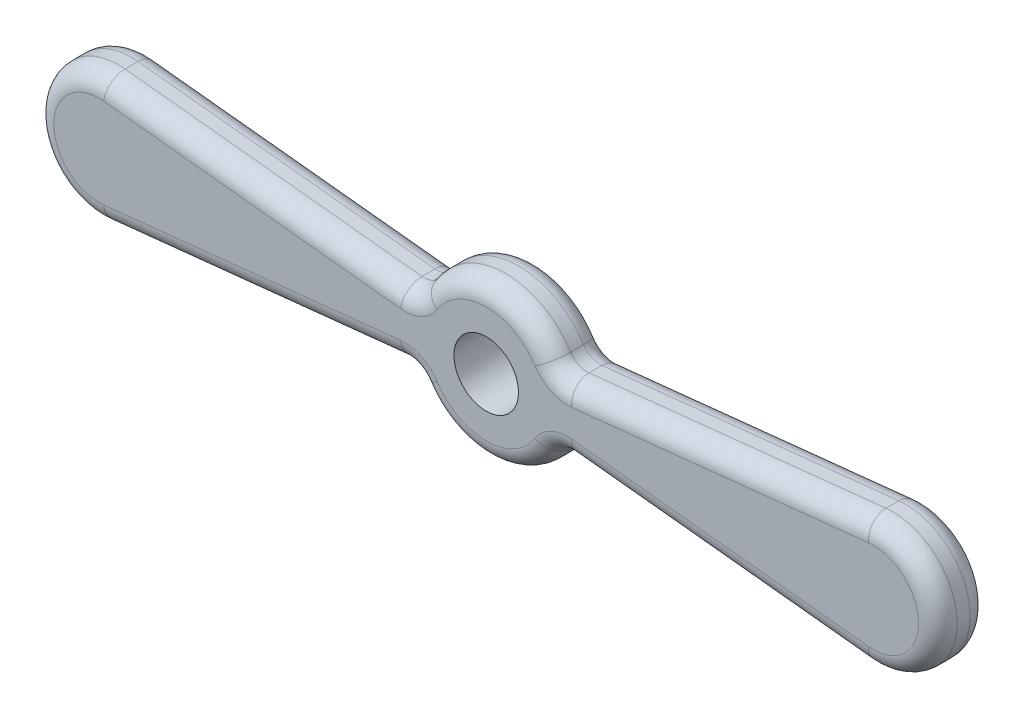
ISO-10303-21;
HEADER;
FILE_DESCRIPTION(('STEP AP214'),'2;1');
FILE_NAME('part.step','',(''),(''),'','','');
FILE_SCHEMA(('AUTOMOTIVE_DESIGN { 1 0 10303 214 1 1 1 1 }'));
ENDSEC;
DATA;
#1=APPLICATION_CONTEXT('core data for automotive mechanical design processes');
#2=APPLICATION_PROTOCOL_DEFINITION('international standard','automotive_design',2000,#1);
#3=PRODUCT_CONTEXT('',#1,'mechanical');
#4=PRODUCT('Part','Part','',(#3));
#5=PRODUCT_RELATED_PRODUCT_CATEGORY('part','',(#4));
#6=PRODUCT_DEFINITION_FORMATION('','',#4);
#7=PRODUCT_DEFINITION_CONTEXT('part definition',#1,'design');
#8=PRODUCT_DEFINITION('design','',#6,#7);
#9=PRODUCT_DEFINITION_SHAPE('','',#8);
#10=(LENGTH_UNIT() NAMED_UNIT(*) SI_UNIT(.MILLI.,.METRE.));
#11=(NAMED_UNIT(*) PLANE_ANGLE_UNIT() SI_UNIT($,.RADIAN.));
#12=(NAMED_UNIT(*) SI_UNIT($,.STERADIAN.) SOLID_ANGLE_UNIT());
#13=UNCERTAINTY_MEASURE_WITH_UNIT(LENGTH_MEASURE(1.E-05),#10,'distance_accuracy_value','');
#14=(GEOMETRIC_REPRESENTATION_CONTEXT(3) GLOBAL_UNCERTAINTY_ASSIGNED_CONTEXT((#13)) GLOBAL_UNIT_ASSIGNED_CONTEXT((#10,
#11,#12)) REPRESENTATION_CONTEXT('',''));
#15=CARTESIAN_POINT('',(0.,0.,0.));
#16=DIRECTION('',(0.,0.,1.));
#17=DIRECTION('',(1.,0.,0.));
#18=AXIS2_PLACEMENT_3D('',#15,#16,#17);
#19=CARTESIAN_POINT('',(60.,0.,8.));
#20=DIRECTION('',(0.,0.,1.));
#21=DIRECTION('',(1.,0.,0.));
#22=AXIS2_PLACEMENT_3D('',#19,#20,#21);
#23=PLANE('',#22);
#24=CARTESIAN_POINT('',(12.6296055117587,-8.09277854740601,8.));
#25=DIRECTION('',(0.,0.,1.));
#26=DIRECTION('',(1.,0.,0.));
#27=AXIS2_PLACEMENT_3D('',#24,#25,#26);
#28=CIRCLE('',#27,6.);
#29=CARTESIAN_POINT('',(7.57776330705521,-4.85566712844361,8.));
#30=VERTEX_POINT('',#29);
#31=CARTESIAN_POINT('',(13.2567762913646,-2.12564717519637,8.));
#32=VERTEX_POINT('',#31);
#33=EDGE_CURVE('E241',#30,#32,#28,.F.);
#34=ORIENTED_EDGE('',*,*,#33,.T.);
#35=DIRECTION('',(0.994521895368274,-0.104528463267647,0.));
#36=VECTOR('',#35,1.);
#37=CARTESIAN_POINT('',(59.2683007571265,-6.96165326757792,8.));
#38=LINE('',#37,#36);
#39=CARTESIAN_POINT('',(59.2683007571265,-6.96165326757792,8.));
#40=VERTEX_POINT('',#39);
#41=EDGE_CURVE('E249',#32,#40,#38,.T.);
#42=ORIENTED_EDGE('',*,*,#41,.T.);
#43=CARTESIAN_POINT('',(60.,0.,8.));
#44=DIRECTION('',(0.,0.,1.));
#45=DIRECTION('',(1.,0.,0.));
#46=AXIS2_PLACEMENT_3D('',#43,#44,#45);
#47=CIRCLE('',#46,7.);
#48=CARTESIAN_POINT('',(59.2683007571265,6.96165326757791,8.));
#49=VERTEX_POINT('',#48);
#50=EDGE_CURVE('E247',#40,#49,#47,.T.);
#51=ORIENTED_EDGE('',*,*,#50,.T.);
#52=DIRECTION('',(-0.994521895368274,-0.104528463267647,0.));
#53=VECTOR('',#52,1.);
#54=CARTESIAN_POINT('',(13.2567762913645,2.12564717519637,8.));
#55=LINE('',#54,#53);
#56=CARTESIAN_POINT('',(13.2567762913646,2.12564717519637,8.));
#57=VERTEX_POINT('',#56);
#58=EDGE_CURVE('E245',#49,#57,#55,.T.);
#59=ORIENTED_EDGE('',*,*,#58,.T.);
#60=CARTESIAN_POINT('',(12.6296055117587,8.09277854740601,8.));
#61=DIRECTION('',(0.,0.,1.));
#62=DIRECTION('',(1.,0.,0.));
#63=AXIS2_PLACEMENT_3D('',#60,#61,#62);
#64=CIRCLE('',#63,6.);
#65=CARTESIAN_POINT('',(7.57776330705521,4.85566712844361,8.));
#66=VERTEX_POINT('',#65);
#67=EDGE_CURVE('E243',#57,#66,#64,.F.);
#68=ORIENTED_EDGE('',*,*,#67,.T.);
#69=CARTESIAN_POINT('',(0.,0.,8.));
#70=DIRECTION('',(0.,0.,1.));
#71=DIRECTION('',(1.,0.,0.));
#72=AXIS2_PLACEMENT_3D('',#69,#70,#71);
#73=CIRCLE('',#72,9.);
#74=CARTESIAN_POINT('',(-7.57776330705521,4.85566712844361,8.));
#75=VERTEX_POINT('',#74);
#76=EDGE_CURVE('E230',#66,#75,#73,.T.);
#77=ORIENTED_EDGE('',*,*,#76,.T.);
#78=CARTESIAN_POINT('',(-12.6296055117587,8.09277854740601,8.));
#79=DIRECTION('',(0.,0.,1.));
#80=DIRECTION('',(1.,0.,0.));
#81=AXIS2_PLACEMENT_3D('',#78,#79,#80);
#82=CIRCLE('',#81,6.);
#83=CARTESIAN_POINT('',(-13.2567762913646,2.12564717519637,8.));
#84=VERTEX_POINT('',#83);
#85=EDGE_CURVE('E211',#75,#84,#82,.F.);
#86=ORIENTED_EDGE('',*,*,#85,.T.);
#87=DIRECTION('',(-0.994521895368274,0.104528463267647,0.));
#88=VECTOR('',#87,1.);
#89=CARTESIAN_POINT('',(-59.2683007571265,6.96165326757791,8.));
#90=LINE('',#89,#88);
#91=CARTESIAN_POINT('',(-59.2683007571265,6.96165326757791,8.));
#92=VERTEX_POINT('',#91);
#93=EDGE_CURVE('E219',#84,#92,#90,.T.);
#94=ORIENTED_EDGE('',*,*,#93,.T.);
#95=CARTESIAN_POINT('',(-60.,0.,8.));
#96=DIRECTION('',(0.,0.,1.));
#97=DIRECTION('',(1.,0.,0.));
#98=AXIS2_PLACEMENT_3D('',#95,#96,#97);
#99=CIRCLE('',#98,7.);
#100=CARTESIAN_POINT('',(-59.2683007571265,-6.96165326757791,8.));
#101=VERTEX_POINT('',#100);
#102=EDGE_CURVE('E225',#92,#101,#99,.T.);
#103=ORIENTED_EDGE('',*,*,#102,.T.);
#104=DIRECTION('',(0.994521895368274,0.104528463267647,0.));
#105=VECTOR('',#104,1.);
#106=CARTESIAN_POINT('',(-13.2567762913645,-2.12564717519636,8.));
#107=LINE('',#106,#105);
#108=CARTESIAN_POINT('',(-13.2567762913646,-2.12564717519637,8.));
#109=VERTEX_POINT('',#108);
#110=EDGE_CURVE('E236',#101,#109,#107,.T.);
#111=ORIENTED_EDGE('',*,*,#110,.T.);
#112=CARTESIAN_POINT('',(-12.6296055117587,-8.09277854740601,8.));
#113=DIRECTION('',(0.,0.,1.));
#114=DIRECTION('',(1.,0.,0.));
#115=AXIS2_PLACEMENT_3D('',#112,#113,#114);
#116=CIRCLE('',#115,6.);
#117=CARTESIAN_POINT('',(-7.57776330705521,-4.85566712844361,8.));
#118=VERTEX_POINT('',#117);
#119=EDGE_CURVE('E233',#109,#118,#116,.F.);
#120=ORIENTED_EDGE('',*,*,#119,.T.);
#121=CARTESIAN_POINT('',(0.,0.,8.));
#122=DIRECTION('',(0.,0.,1.));
#123=DIRECTION('',(1.,0.,0.));
#124=AXIS2_PLACEMENT_3D('',#121,#122,#123);
#125=CIRCLE('',#124,9.);
#126=EDGE_CURVE('E232',#118,#30,#125,.T.);
#127=ORIENTED_EDGE('',*,*,#126,.T.);
#128=EDGE_LOOP('',(#34,#42,#51,#59,#68,#77,#86,#94,#103,#111,#120,#127));
#129=FACE_BOUND('',#128,.T.);
#130=CARTESIAN_POINT('',(0.,0.,8.));
#131=DIRECTION('',(0.,0.,1.));
#132=DIRECTION('',(1.,0.,0.));
#133=AXIS2_PLACEMENT_3D('',#130,#131,#132);
#134=CIRCLE('',#133,5.);
#135=CARTESIAN_POINT('',(5.,0.,8.));
#136=VERTEX_POINT('',#135);
#137=EDGE_CURVE('E441',#136,#136,#134,.T.);
#138=ORIENTED_EDGE('',*,*,#137,.F.);
#139=EDGE_LOOP('',(#138));
#140=FACE_BOUND('',#139,.T.);
#141=ADVANCED_FACE('F42',(#129,#140),#23,.T.);
#142=CARTESIAN_POINT('',(60.,0.,0.));
#143=DIRECTION('',(0.,0.,1.));
#144=DIRECTION('',(1.,0.,0.));
#145=AXIS2_PLACEMENT_3D('',#142,#143,#144);
#146=PLANE('',#145);
#147=DIRECTION('',(-0.994521895368274,0.104528463267647,0.));
#148=VECTOR('',#147,1.);
#149=CARTESIAN_POINT('',(59.420555286902,-5.51304818148684,0.));
#150=LINE('',#149,#148);
#151=CARTESIAN_POINT('',(-59.2683007571265,6.96165326757791,0.));
#152=VERTEX_POINT('',#151);
#153=CARTESIAN_POINT('',(-13.2567762913646,2.12564717519637,0.));
#154=VERTEX_POINT('',#153);
#155=EDGE_CURVE('E276',#152,#154,#150,.F.);
#156=ORIENTED_EDGE('',*,*,#155,.T.);
#157=CARTESIAN_POINT('',(-12.6296055117587,8.09277854740601,0.));
#158=DIRECTION('',(0.,0.,1.));
#159=DIRECTION('',(1.,0.,0.));
#160=AXIS2_PLACEMENT_3D('',#157,#158,#159);
#161=CIRCLE('',#160,6.);
#162=CARTESIAN_POINT('',(-7.57776330705521,4.85566712844361,0.));
#163=VERTEX_POINT('',#162);
#164=EDGE_CURVE('E329',#154,#163,#161,.T.);
#165=ORIENTED_EDGE('',*,*,#164,.T.);
#166=CARTESIAN_POINT('',(0.,0.,0.));
#167=DIRECTION('',(0.,0.,1.));
#168=DIRECTION('',(1.,0.,0.));
#169=AXIS2_PLACEMENT_3D('',#166,#167,#168);
#170=CIRCLE('',#169,9.);
#171=CARTESIAN_POINT('',(7.57776330705521,4.85566712844361,0.));
#172=VERTEX_POINT('',#171);
#173=EDGE_CURVE('E327',#163,#172,#170,.F.);
#174=ORIENTED_EDGE('',*,*,#173,.T.);
#175=CARTESIAN_POINT('',(12.6296055117587,8.09277854740601,0.));
#176=DIRECTION('',(0.,0.,1.));
#177=DIRECTION('',(1.,0.,0.));
#178=AXIS2_PLACEMENT_3D('',#175,#176,#177);
#179=CIRCLE('',#178,6.);
#180=CARTESIAN_POINT('',(13.2567762913646,2.12564717519637,0.));
#181=VERTEX_POINT('',#180);
#182=EDGE_CURVE('E325',#172,#181,#179,.T.);
#183=ORIENTED_EDGE('',*,*,#182,.T.);
#184=DIRECTION('',(-0.994521895368274,-0.104528463267647,0.));
#185=VECTOR('',#184,1.);
#186=CARTESIAN_POINT('',(59.2683007571265,6.96165326757792,0.));
#187=LINE('',#186,#185);
#188=CARTESIAN_POINT('',(59.2683007571265,6.96165326757791,0.));
#189=VERTEX_POINT('',#188);
#190=EDGE_CURVE('E323',#181,#189,#187,.F.);
#191=ORIENTED_EDGE('',*,*,#190,.T.);
#192=CARTESIAN_POINT('',(60.,0.,0.));
#193=DIRECTION('',(0.,0.,1.));
#194=DIRECTION('',(1.,0.,0.));
#195=AXIS2_PLACEMENT_3D('',#192,#193,#194);
#196=CIRCLE('',#195,7.);
#197=CARTESIAN_POINT('',(59.2683007571265,-6.96165326757791,0.));
#198=VERTEX_POINT('',#197);
#199=EDGE_CURVE('E321',#189,#198,#196,.F.);
#200=ORIENTED_EDGE('',*,*,#199,.T.);
#201=DIRECTION('',(0.994521895368274,-0.104528463267647,0.));
#202=VECTOR('',#201,1.);
#203=CARTESIAN_POINT('',(59.2683007571265,-6.96165326757791,0.));
#204=LINE('',#203,#202);
#205=CARTESIAN_POINT('',(13.2567762913646,-2.12564717519637,0.));
#206=VERTEX_POINT('',#205);
#207=EDGE_CURVE('E319',#198,#206,#204,.F.);
#208=ORIENTED_EDGE('',*,*,#207,.T.);
#209=CARTESIAN_POINT('',(12.6296055117587,-8.09277854740601,0.));
#210=DIRECTION('',(0.,0.,1.));
#211=DIRECTION('',(1.,0.,0.));
#212=AXIS2_PLACEMENT_3D('',#209,#210,#211);
#213=CIRCLE('',#212,6.);
#214=CARTESIAN_POINT('',(7.57776330705521,-4.85566712844361,0.));
#215=VERTEX_POINT('',#214);
#216=EDGE_CURVE('E317',#206,#215,#213,.T.);
#217=ORIENTED_EDGE('',*,*,#216,.T.);
#218=CARTESIAN_POINT('',(0.,0.,0.));
#219=DIRECTION('',(0.,0.,1.));
#220=DIRECTION('',(1.,0.,0.));
#221=AXIS2_PLACEMENT_3D('',#218,#219,#220);
#222=CIRCLE('',#221,9.);
#223=CARTESIAN_POINT('',(-7.57776330705521,-4.85566712844361,0.));
#224=VERTEX_POINT('',#223);
#225=EDGE_CURVE('E315',#215,#224,#222,.F.);
#226=ORIENTED_EDGE('',*,*,#225,.T.);
#227=CARTESIAN_POINT('',(-12.6296055117587,-8.09277854740601,0.));
#228=DIRECTION('',(0.,0.,1.));
#229=DIRECTION('',(1.,0.,0.));
#230=AXIS2_PLACEMENT_3D('',#227,#228,#229);
#231=CIRCLE('',#230,6.);
#232=CARTESIAN_POINT('',(-13.2567762913646,-2.12564717519637,0.));
#233=VERTEX_POINT('',#232);
#234=EDGE_CURVE('E313',#224,#233,#231,.T.);
#235=ORIENTED_EDGE('',*,*,#234,.T.);
#236=DIRECTION('',(0.994521895368274,0.104528463267647,0.));
#237=VECTOR('',#236,1.);
#238=CARTESIAN_POINT('',(59.420555286902,5.51304818148684,0.));
#239=LINE('',#238,#237);
#240=CARTESIAN_POINT('',(-59.2683007571265,-6.96165326757791,0.));
#241=VERTEX_POINT('',#240);
#242=EDGE_CURVE('E311',#233,#241,#239,.F.);
#243=ORIENTED_EDGE('',*,*,#242,.T.);
#244=CARTESIAN_POINT('',(-60.,0.,0.));
#245=DIRECTION('',(0.,0.,1.));
#246=DIRECTION('',(1.,0.,0.));
#247=AXIS2_PLACEMENT_3D('',#244,#245,#246);
#248=CIRCLE('',#247,7.);
#249=EDGE_CURVE('E309',#241,#152,#248,.F.);
#250=ORIENTED_EDGE('',*,*,#249,.T.);
#251=EDGE_LOOP('',(#156,#165,#174,#183,#191,#200,#208,#217,#226,#235,#243,#250));
#252=FACE_BOUND('',#251,.T.);
#253=CARTESIAN_POINT('',(0.,0.,0.));
#254=DIRECTION('',(0.,0.,1.));
#255=DIRECTION('',(1.,0.,0.));
#256=AXIS2_PLACEMENT_3D('',#253,#254,#255);
#257=CIRCLE('',#256,5.);
#258=CARTESIAN_POINT('',(5.,0.,0.));
#259=VERTEX_POINT('',#258);
#260=EDGE_CURVE('E307',#259,#259,#257,.T.);
#261=ORIENTED_EDGE('',*,*,#260,.T.);
#262=EDGE_LOOP('',(#261));
#263=FACE_BOUND('',#262,.T.);
#264=ADVANCED_FACE('F510',(#252,#263),#146,.F.);
#265=CARTESIAN_POINT('',(60.,0.,8.));
#266=DIRECTION('',(0.,0.,-1.));
#267=DIRECTION('',(-1.,0.,0.));
#268=AXIS2_PLACEMENT_3D('',#265,#266,#267);
#269=CYLINDRICAL_SURFACE('',#268,10.);
#270=DIRECTION('',(0.,0.,-1.));
#271=VECTOR('',#270,1.);
#272=CARTESIAN_POINT('',(58.9547153673235,-9.94521895368274,8.));
#273=LINE('',#272,#271);
#274=CARTESIAN_POINT('',(58.9547153673235,-9.94521895368274,5.));
#275=VERTEX_POINT('',#274);
#276=CARTESIAN_POINT('',(58.9547153673235,-9.94521895368274,3.));
#277=VERTEX_POINT('',#276);
#278=EDGE_CURVE('E437',#275,#277,#273,.T.);
#279=ORIENTED_EDGE('',*,*,#278,.T.);
#280=CARTESIAN_POINT('',(60.,0.,3.));
#281=DIRECTION('',(0.,0.,1.));
#282=DIRECTION('',(1.,0.,0.));
#283=AXIS2_PLACEMENT_3D('',#280,#281,#282);
#284=CIRCLE('',#283,10.);
#285=CARTESIAN_POINT('',(58.9547153673235,9.94521895368274,3.));
#286=VERTEX_POINT('',#285);
#287=EDGE_CURVE('E341',#277,#286,#284,.T.);
#288=ORIENTED_EDGE('',*,*,#287,.T.);
#289=DIRECTION('',(0.,0.,-1.));
#290=VECTOR('',#289,1.);
#291=CARTESIAN_POINT('',(58.9547153673235,9.94521895368274,8.));
#292=LINE('',#291,#290);
#293=CARTESIAN_POINT('',(58.9547153673235,9.94521895368274,5.));
#294=VERTEX_POINT('',#293);
#295=EDGE_CURVE('E439',#294,#286,#292,.T.);
#296=ORIENTED_EDGE('',*,*,#295,.F.);
#297=CARTESIAN_POINT('',(60.,0.,5.));
#298=DIRECTION('',(0.,0.,1.));
#299=DIRECTION('',(1.,0.,0.));
#300=AXIS2_PLACEMENT_3D('',#297,#298,#299);
#301=CIRCLE('',#300,10.);
#302=EDGE_CURVE('E260',#294,#275,#301,.F.);
#303=ORIENTED_EDGE('',*,*,#302,.T.);
#304=EDGE_LOOP('',(#279,#288,#296,#303));
#305=FACE_BOUND('',#304,.T.);
#306=ADVANCED_FACE('F515',(#305),#269,.T.);
#307=CARTESIAN_POINT('',(58.9547153673235,9.94521895368274,8.));
#308=DIRECTION('',(0.104528463267647,-0.994521895368274,0.));
#309=DIRECTION('',(0.994521895368274,0.104528463267647,0.));
#310=AXIS2_PLACEMENT_3D('',#307,#308,#309);
#311=PLANE('',#310);
#312=ORIENTED_EDGE('',*,*,#295,.T.);
#313=DIRECTION('',(-0.994521895368274,-0.104528463267647,0.));
#314=VECTOR('',#313,1.);
#315=CARTESIAN_POINT('',(58.9547153673235,9.94521895368274,3.));
#316=LINE('',#315,#314);
#317=CARTESIAN_POINT('',(12.9431909015616,5.10921286130119,3.));
#318=VERTEX_POINT('',#317);
#319=EDGE_CURVE('E339',#286,#318,#316,.T.);
#320=ORIENTED_EDGE('',*,*,#319,.T.);
#321=DIRECTION('',(0.,0.,1.));
#322=VECTOR('',#321,1.);
#323=CARTESIAN_POINT('',(12.9431909015616,5.10921286130119,8.));
#324=LINE('',#323,#322);
#325=CARTESIAN_POINT('',(12.9431909015616,5.10921286130119,5.));
#326=VERTEX_POINT('',#325);
#327=EDGE_CURVE('E226',#318,#326,#324,.T.);
#328=ORIENTED_EDGE('',*,*,#327,.T.);
#329=DIRECTION('',(-0.994521895368274,-0.104528463267647,0.));
#330=VECTOR('',#329,1.);
#331=CARTESIAN_POINT('',(58.9547153673235,9.94521895368274,5.));
#332=LINE('',#331,#330);
#333=EDGE_CURVE('E262',#326,#294,#332,.F.);
#334=ORIENTED_EDGE('',*,*,#333,.T.);
#335=EDGE_LOOP('',(#312,#320,#328,#334));
#336=FACE_BOUND('',#335,.T.);
#337=ADVANCED_FACE('F534',(#336),#311,.F.);
#338=CARTESIAN_POINT('',(0.,0.,8.));
#339=DIRECTION('',(0.,0.,-1.));
#340=DIRECTION('',(-1.,0.,0.));
#341=AXIS2_PLACEMENT_3D('',#338,#339,#340);
#342=CYLINDRICAL_SURFACE('',#341,12.);
#343=DIRECTION('',(0.,0.,-1.));
#344=VECTOR('',#343,1.);
#345=CARTESIAN_POINT('',(10.1036844094069,6.47422283792481,8.));
#346=LINE('',#345,#344);
#347=CARTESIAN_POINT('',(10.1036844094069,6.47422283792481,5.));
#348=VERTEX_POINT('',#347);
#349=CARTESIAN_POINT('',(10.1036844094069,6.47422283792481,3.));
#350=VERTEX_POINT('',#349);
#351=EDGE_CURVE('E449',#348,#350,#346,.T.);
#352=ORIENTED_EDGE('',*,*,#351,.T.);
#353=CARTESIAN_POINT('',(0.,0.,3.));
#354=DIRECTION('',(0.,0.,1.));
#355=DIRECTION('',(1.,0.,0.));
#356=AXIS2_PLACEMENT_3D('',#353,#354,#355);
#357=CIRCLE('',#356,12.);
#358=CARTESIAN_POINT('',(-10.1036844094069,6.47422283792481,3.));
#359=VERTEX_POINT('',#358);
#360=EDGE_CURVE('E335',#350,#359,#357,.T.);
#361=ORIENTED_EDGE('',*,*,#360,.T.);
#362=DIRECTION('',(0.,0.,-1.));
#363=VECTOR('',#362,1.);
#364=CARTESIAN_POINT('',(-10.1036844094069,6.47422283792481,8.));
#365=LINE('',#364,#363);
#366=CARTESIAN_POINT('',(-10.1036844094069,6.47422283792481,5.));
#367=VERTEX_POINT('',#366);
#368=EDGE_CURVE('E452',#359,#367,#365,.F.);
#369=ORIENTED_EDGE('',*,*,#368,.T.);
#370=CARTESIAN_POINT('',(0.,0.,5.));
#371=DIRECTION('',(0.,0.,1.));
#372=DIRECTION('',(1.,0.,0.));
#373=AXIS2_PLACEMENT_3D('',#370,#371,#372);
#374=CIRCLE('',#373,12.);
#375=EDGE_CURVE('E264',#367,#348,#374,.F.);
#376=ORIENTED_EDGE('',*,*,#375,.T.);
#377=EDGE_LOOP('',(#352,#361,#369,#376));
#378=FACE_BOUND('',#377,.T.);
#379=ADVANCED_FACE('F531',(#378),#342,.T.);
#380=CARTESIAN_POINT('',(-58.9547153673235,9.94521895368274,8.));
#381=DIRECTION('',(-0.104528463267647,-0.994521895368274,0.));
#382=DIRECTION('',(0.994521895368274,-0.104528463267647,0.));
#383=AXIS2_PLACEMENT_3D('',#380,#381,#382);
#384=PLANE('',#383);
#385=DIRECTION('',(0.,0.,1.));
#386=VECTOR('',#385,1.);
#387=CARTESIAN_POINT('',(-12.9431909015616,5.10921286130119,0.));
#388=LINE('',#387,#386);
#389=CARTESIAN_POINT('',(-12.9431909015616,5.10921286130119,5.));
#390=VERTEX_POINT('',#389);
#391=CARTESIAN_POINT('',(-12.9431909015616,5.10921286130119,3.));
#392=VERTEX_POINT('',#391);
#393=EDGE_CURVE('E447',#390,#392,#388,.F.);
#394=ORIENTED_EDGE('',*,*,#393,.T.);
#395=DIRECTION('',(-0.994521895368274,0.104528463267647,0.));
#396=VECTOR('',#395,1.);
#397=CARTESIAN_POINT('',(-58.9547153673235,9.94521895368274,3.));
#398=LINE('',#397,#396);
#399=CARTESIAN_POINT('',(-58.9547153673235,9.94521895368274,3.));
#400=VERTEX_POINT('',#399);
#401=EDGE_CURVE('E11',#392,#400,#398,.T.);
#402=ORIENTED_EDGE('',*,*,#401,.T.);
#403=DIRECTION('',(0.,0.,-1.));
#404=VECTOR('',#403,1.);
#405=CARTESIAN_POINT('',(-58.9547153673235,9.94521895368274,8.));
#406=LINE('',#405,#404);
#407=CARTESIAN_POINT('',(-58.9547153673235,9.94521895368274,5.));
#408=VERTEX_POINT('',#407);
#409=EDGE_CURVE('E436',#408,#400,#406,.T.);
#410=ORIENTED_EDGE('',*,*,#409,.F.);
#411=DIRECTION('',(-0.994521895368274,0.104528463267647,0.));
#412=VECTOR('',#411,1.);
#413=CARTESIAN_POINT('',(-12.9431909015616,5.10921286130119,5.));
#414=LINE('',#413,#412);
#415=EDGE_CURVE('E275',#408,#390,#414,.F.);
#416=ORIENTED_EDGE('',*,*,#415,.T.);
#417=EDGE_LOOP('',(#394,#402,#410,#416));
#418=FACE_BOUND('',#417,.T.);
#419=ADVANCED_FACE('F498',(#418),#384,.F.);
#420=CARTESIAN_POINT('',(-60.,0.,8.));
#421=DIRECTION('',(0.,0.,-1.));
#422=DIRECTION('',(-1.,0.,0.));
#423=AXIS2_PLACEMENT_3D('',#420,#421,#422);
#424=CYLINDRICAL_SURFACE('',#423,10.);
#425=ORIENTED_EDGE('',*,*,#409,.T.);
#426=CARTESIAN_POINT('',(-60.,0.,3.));
#427=DIRECTION('',(0.,0.,1.));
#428=DIRECTION('',(1.,0.,0.));
#429=AXIS2_PLACEMENT_3D('',#426,#427,#428);
#430=CIRCLE('',#429,10.);
#431=CARTESIAN_POINT('',(-58.9547153673235,-9.94521895368274,3.));
#432=VERTEX_POINT('',#431);
#433=EDGE_CURVE('E51',#400,#432,#430,.T.);
#434=ORIENTED_EDGE('',*,*,#433,.T.);
#435=DIRECTION('',(0.,0.,-1.));
#436=VECTOR('',#435,1.);
#437=CARTESIAN_POINT('',(-58.9547153673235,-9.94521895368274,8.));
#438=LINE('',#437,#436);
#439=CARTESIAN_POINT('',(-58.9547153673235,-9.94521895368274,5.));
#440=VERTEX_POINT('',#439);
#441=EDGE_CURVE('E432',#440,#432,#438,.T.);
#442=ORIENTED_EDGE('',*,*,#441,.F.);
#443=CARTESIAN_POINT('',(-60.,0.,5.));
#444=DIRECTION('',(0.,0.,1.));
#445=DIRECTION('',(1.,0.,0.));
#446=AXIS2_PLACEMENT_3D('',#443,#444,#445);
#447=CIRCLE('',#446,10.);
#448=EDGE_CURVE('E273',#440,#408,#447,.F.);
#449=ORIENTED_EDGE('',*,*,#448,.T.);
#450=EDGE_LOOP('',(#425,#434,#442,#449));
#451=FACE_BOUND('',#450,.T.);
#452=ADVANCED_FACE('F435',(#451),#424,.T.);
#453=CARTESIAN_POINT('',(-58.9547153673235,-9.94521895368274,8.));
#454=DIRECTION('',(-0.104528463267647,0.994521895368274,0.));
#455=DIRECTION('',(-0.994521895368274,-0.104528463267647,0.));
#456=AXIS2_PLACEMENT_3D('',#453,#454,#455);
#457=PLANE('',#456);
#458=ORIENTED_EDGE('',*,*,#441,.T.);
#459=DIRECTION('',(0.994521895368274,0.104528463267647,0.));
#460=VECTOR('',#459,1.);
#461=CARTESIAN_POINT('',(-58.9547153673235,-9.94521895368274,3.));
#462=LINE('',#461,#460);
#463=CARTESIAN_POINT('',(-12.9431909015616,-5.10921286130119,3.));
#464=VERTEX_POINT('',#463);
#465=EDGE_CURVE('E351',#432,#464,#462,.T.);
#466=ORIENTED_EDGE('',*,*,#465,.T.);
#467=DIRECTION('',(0.,0.,1.));
#468=VECTOR('',#467,1.);
#469=CARTESIAN_POINT('',(-12.9431909015616,-5.10921286130119,8.));
#470=LINE('',#469,#468);
#471=CARTESIAN_POINT('',(-12.9431909015616,-5.10921286130119,5.));
#472=VERTEX_POINT('',#471);
#473=EDGE_CURVE('E410',#464,#472,#470,.T.);
#474=ORIENTED_EDGE('',*,*,#473,.T.);
#475=DIRECTION('',(0.994521895368274,0.104528463267647,0.));
#476=VECTOR('',#475,1.);
#477=CARTESIAN_POINT('',(-58.9547153673235,-9.94521895368274,5.));
#478=LINE('',#477,#476);
#479=EDGE_CURVE('E271',#472,#440,#478,.F.);
#480=ORIENTED_EDGE('',*,*,#479,.T.);
#481=EDGE_LOOP('',(#458,#466,#474,#480));
#482=FACE_BOUND('',#481,.T.);
#483=ADVANCED_FACE('F431',(#482),#457,.F.);
#484=CARTESIAN_POINT('',(0.,0.,8.));
#485=DIRECTION('',(0.,0.,-1.));
#486=DIRECTION('',(-1.,0.,0.));
#487=AXIS2_PLACEMENT_3D('',#484,#485,#486);
#488=CYLINDRICAL_SURFACE('',#487,12.);
#489=DIRECTION('',(0.,0.,-1.));
#490=VECTOR('',#489,1.);
#491=CARTESIAN_POINT('',(-10.1036844094069,-6.47422283792481,8.));
#492=LINE('',#491,#490);
#493=CARTESIAN_POINT('',(-10.1036844094069,-6.47422283792481,5.));
#494=VERTEX_POINT('',#493);
#495=CARTESIAN_POINT('',(-10.1036844094069,-6.47422283792481,3.));
#496=VERTEX_POINT('',#495);
#497=EDGE_CURVE('E413',#494,#496,#492,.T.);
#498=ORIENTED_EDGE('',*,*,#497,.T.);
#499=CARTESIAN_POINT('',(0.,0.,3.));
#500=DIRECTION('',(0.,0.,1.));
#501=DIRECTION('',(1.,0.,0.));
#502=AXIS2_PLACEMENT_3D('',#499,#500,#501);
#503=CIRCLE('',#502,12.);
#504=CARTESIAN_POINT('',(10.1036844094069,-6.47422283792481,3.));
#505=VERTEX_POINT('',#504);
#506=EDGE_CURVE('E347',#496,#505,#503,.T.);
#507=ORIENTED_EDGE('',*,*,#506,.T.);
#508=DIRECTION('',(0.,0.,-1.));
#509=VECTOR('',#508,1.);
#510=CARTESIAN_POINT('',(10.1036844094069,-6.47422283792481,8.));
#511=LINE('',#510,#509);
#512=CARTESIAN_POINT('',(10.1036844094069,-6.47422283792481,5.));
#513=VERTEX_POINT('',#512);
#514=EDGE_CURVE('E404',#505,#513,#511,.F.);
#515=ORIENTED_EDGE('',*,*,#514,.T.);
#516=CARTESIAN_POINT('',(0.,0.,5.));
#517=DIRECTION('',(0.,0.,1.));
#518=DIRECTION('',(1.,0.,0.));
#519=AXIS2_PLACEMENT_3D('',#516,#517,#518);
#520=CIRCLE('',#519,12.);
#521=EDGE_CURVE('E269',#513,#494,#520,.F.);
#522=ORIENTED_EDGE('',*,*,#521,.T.);
#523=EDGE_LOOP('',(#498,#507,#515,#522));
#524=FACE_BOUND('',#523,.T.);
#525=ADVANCED_FACE('F457',(#524),#488,.T.);
#526=CARTESIAN_POINT('',(58.9547153673235,-9.94521895368274,8.));
#527=DIRECTION('',(0.104528463267647,0.994521895368274,0.));
#528=DIRECTION('',(-0.994521895368274,0.104528463267647,0.));
#529=AXIS2_PLACEMENT_3D('',#526,#527,#528);
#530=PLANE('',#529);
#531=DIRECTION('',(0.,0.,1.));
#532=VECTOR('',#531,1.);
#533=CARTESIAN_POINT('',(12.9431909015616,-5.10921286130119,0.));
#534=LINE('',#533,#532);
#535=CARTESIAN_POINT('',(12.9431909015616,-5.10921286130119,5.));
#536=VERTEX_POINT('',#535);
#537=CARTESIAN_POINT('',(12.9431909015616,-5.10921286130119,3.));
#538=VERTEX_POINT('',#537);
#539=EDGE_CURVE('E402',#536,#538,#534,.F.);
#540=ORIENTED_EDGE('',*,*,#539,.T.);
#541=DIRECTION('',(0.994521895368274,-0.104528463267647,0.));
#542=VECTOR('',#541,1.);
#543=CARTESIAN_POINT('',(58.9547153673235,-9.94521895368274,3.));
#544=LINE('',#543,#542);
#545=EDGE_CURVE('E343',#538,#277,#544,.T.);
#546=ORIENTED_EDGE('',*,*,#545,.T.);
#547=ORIENTED_EDGE('',*,*,#278,.F.);
#548=DIRECTION('',(0.994521895368274,-0.104528463267647,0.));
#549=VECTOR('',#548,1.);
#550=CARTESIAN_POINT('',(12.9431909015616,-5.10921286130119,5.));
#551=LINE('',#550,#549);
#552=EDGE_CURVE('E258',#275,#536,#551,.F.);
#553=ORIENTED_EDGE('',*,*,#552,.T.);
#554=EDGE_LOOP('',(#540,#546,#547,#553));
#555=FACE_BOUND('',#554,.T.);
#556=ADVANCED_FACE('F406',(#555),#530,.F.);
#557=CARTESIAN_POINT('',(0.,0.,8.));
#558=DIRECTION('',(0.,0.,-1.));
#559=DIRECTION('',(-1.,0.,0.));
#560=AXIS2_PLACEMENT_3D('',#557,#558,#559);
#561=CYLINDRICAL_SURFACE('',#560,5.);
#562=ORIENTED_EDGE('',*,*,#137,.T.);
#563=EDGE_LOOP('',(#562));
#564=FACE_BOUND('',#563,.T.);
#565=ORIENTED_EDGE('',*,*,#260,.F.);
#566=EDGE_LOOP('',(#565));
#567=FACE_BOUND('',#566,.T.);
#568=ADVANCED_FACE('F519',(#564,#567),#561,.F.);
#569=CARTESIAN_POINT('',(-12.6296055117587,8.09277854740601,8.));
#570=DIRECTION('',(0.,0.,-1.));
#571=DIRECTION('',(-1.,0.,0.));
#572=AXIS2_PLACEMENT_3D('',#569,#570,#571);
#573=CYLINDRICAL_SURFACE('',#572,3.);
#574=ORIENTED_EDGE('',*,*,#368,.F.);
#575=CARTESIAN_POINT('',(-12.6296055117587,8.09277854740601,3.));
#576=DIRECTION('',(0.,0.,1.));
#577=DIRECTION('',(1.,0.,0.));
#578=AXIS2_PLACEMENT_3D('',#575,#576,#577);
#579=CIRCLE('',#578,3.);
#580=EDGE_CURVE('E332',#359,#392,#579,.F.);
#581=ORIENTED_EDGE('',*,*,#580,.T.);
#582=ORIENTED_EDGE('',*,*,#393,.F.);
#583=CARTESIAN_POINT('',(-12.6296055117587,8.09277854740601,5.));
#584=DIRECTION('',(0.,0.,1.));
#585=DIRECTION('',(1.,0.,0.));
#586=AXIS2_PLACEMENT_3D('',#583,#584,#585);
#587=CIRCLE('',#586,3.);
#588=EDGE_CURVE('E213',#390,#367,#587,.T.);
#589=ORIENTED_EDGE('',*,*,#588,.T.);
#590=EDGE_LOOP('',(#574,#581,#582,#589));
#591=FACE_BOUND('',#590,.T.);
#592=ADVANCED_FACE('F496',(#591),#573,.F.);
#593=CARTESIAN_POINT('',(-12.6296055117587,-8.09277854740601,8.));
#594=DIRECTION('',(0.,0.,-1.));
#595=DIRECTION('',(-1.,0.,0.));
#596=AXIS2_PLACEMENT_3D('',#593,#594,#595);
#597=CYLINDRICAL_SURFACE('',#596,3.);
#598=ORIENTED_EDGE('',*,*,#473,.F.);
#599=CARTESIAN_POINT('',(-12.6296055117587,-8.09277854740601,3.));
#600=DIRECTION('',(0.,0.,1.));
#601=DIRECTION('',(1.,0.,0.));
#602=AXIS2_PLACEMENT_3D('',#599,#600,#601);
#603=CIRCLE('',#602,3.);
#604=EDGE_CURVE('E349',#464,#496,#603,.F.);
#605=ORIENTED_EDGE('',*,*,#604,.T.);
#606=ORIENTED_EDGE('',*,*,#497,.F.);
#607=CARTESIAN_POINT('',(-12.6296055117587,-8.09277854740601,5.));
#608=DIRECTION('',(0.,0.,1.));
#609=DIRECTION('',(1.,0.,0.));
#610=AXIS2_PLACEMENT_3D('',#607,#608,#609);
#611=CIRCLE('',#610,3.);
#612=EDGE_CURVE('E266',#494,#472,#611,.T.);
#613=ORIENTED_EDGE('',*,*,#612,.T.);
#614=EDGE_LOOP('',(#598,#605,#606,#613));
#615=FACE_BOUND('',#614,.T.);
#616=ADVANCED_FACE('F460',(#615),#597,.F.);
#617=CARTESIAN_POINT('',(12.6296055117587,-8.09277854740601,8.));
#618=DIRECTION('',(0.,0.,-1.));
#619=DIRECTION('',(-1.,0.,0.));
#620=AXIS2_PLACEMENT_3D('',#617,#618,#619);
#621=CYLINDRICAL_SURFACE('',#620,3.);
#622=ORIENTED_EDGE('',*,*,#514,.F.);
#623=CARTESIAN_POINT('',(12.6296055117587,-8.09277854740601,3.));
#624=DIRECTION('',(0.,0.,1.));
#625=DIRECTION('',(1.,0.,0.));
#626=AXIS2_PLACEMENT_3D('',#623,#624,#625);
#627=CIRCLE('',#626,3.);
#628=EDGE_CURVE('E345',#505,#538,#627,.F.);
#629=ORIENTED_EDGE('',*,*,#628,.T.);
#630=ORIENTED_EDGE('',*,*,#539,.F.);
#631=CARTESIAN_POINT('',(12.6296055117587,-8.09277854740601,5.));
#632=DIRECTION('',(0.,0.,1.));
#633=DIRECTION('',(1.,0.,0.));
#634=AXIS2_PLACEMENT_3D('',#631,#632,#633);
#635=CIRCLE('',#634,3.);
#636=EDGE_CURVE('E255',#536,#513,#635,.T.);
#637=ORIENTED_EDGE('',*,*,#636,.T.);
#638=EDGE_LOOP('',(#622,#629,#630,#637));
#639=FACE_BOUND('',#638,.T.);
#640=ADVANCED_FACE('F401',(#639),#621,.F.);
#641=CARTESIAN_POINT('',(12.6296055117587,8.09277854740601,8.));
#642=DIRECTION('',(0.,0.,-1.));
#643=DIRECTION('',(-1.,0.,0.));
#644=AXIS2_PLACEMENT_3D('',#641,#642,#643);
#645=CYLINDRICAL_SURFACE('',#644,3.);
#646=ORIENTED_EDGE('',*,*,#327,.F.);
#647=CARTESIAN_POINT('',(12.6296055117587,8.09277854740601,3.));
#648=DIRECTION('',(0.,0.,1.));
#649=DIRECTION('',(1.,0.,0.));
#650=AXIS2_PLACEMENT_3D('',#647,#648,#649);
#651=CIRCLE('',#650,3.);
#652=EDGE_CURVE('E337',#318,#350,#651,.F.);
#653=ORIENTED_EDGE('',*,*,#652,.T.);
#654=ORIENTED_EDGE('',*,*,#351,.F.);
#655=CARTESIAN_POINT('',(12.6296055117587,8.09277854740601,5.));
#656=DIRECTION('',(0.,0.,1.));
#657=DIRECTION('',(1.,0.,0.));
#658=AXIS2_PLACEMENT_3D('',#655,#656,#657);
#659=CIRCLE('',#658,3.);
#660=EDGE_CURVE('E252',#348,#326,#659,.T.);
#661=ORIENTED_EDGE('',*,*,#660,.T.);
#662=EDGE_LOOP('',(#646,#653,#654,#661));
#663=FACE_BOUND('',#662,.T.);
#664=ADVANCED_FACE('F547',(#663),#645,.F.);
#665=CARTESIAN_POINT('',(12.6296055117587,-8.09277854740601,5.));
#666=DIRECTION('',(0.,0.,1.));
#667=DIRECTION('',(1.,0.,0.));
#668=AXIS2_PLACEMENT_3D('',#665,#666,#667);
#669=TOROIDAL_SURFACE('',#668,6.,3.);
#670=CARTESIAN_POINT('',(7.57776330705521,-4.85566712844361,5.));
#671=DIRECTION('',(-0.539518569827067,-0.841973700783912,0.));
#672=DIRECTION('',(0.841973700783912,-0.539518569827067,0.));
#673=AXIS2_PLACEMENT_3D('',#670,#671,#672);
#674=CIRCLE('',#673,3.);
#675=EDGE_CURVE('E301',#513,#30,#674,.T.);
#676=ORIENTED_EDGE('',*,*,#675,.F.);
#677=ORIENTED_EDGE('',*,*,#636,.F.);
#678=CARTESIAN_POINT('',(13.2567762913646,-2.12564717519637,5.));
#679=DIRECTION('',(0.994521895368274,-0.104528463267647,0.));
#680=DIRECTION('',(0.104528463267647,0.994521895368274,0.));
#681=AXIS2_PLACEMENT_3D('',#678,#679,#680);
#682=CIRCLE('',#681,3.);
#683=EDGE_CURVE('E304',#32,#536,#682,.T.);
#684=ORIENTED_EDGE('',*,*,#683,.F.);
#685=ORIENTED_EDGE('',*,*,#33,.F.);
#686=EDGE_LOOP('',(#676,#677,#684,#685));
#687=FACE_BOUND('',#686,.T.);
#688=ADVANCED_FACE('F468',(#687),#669,.T.);
#689=CARTESIAN_POINT('',(59.2683007571265,-6.96165326757792,5.));
#690=DIRECTION('',(-0.994521895368274,0.104528463267647,0.));
#691=DIRECTION('',(-0.104528463267647,-0.994521895368274,0.));
#692=AXIS2_PLACEMENT_3D('',#689,#690,#691);
#693=CYLINDRICAL_SURFACE('',#692,3.);
#694=ORIENTED_EDGE('',*,*,#683,.T.);
#695=ORIENTED_EDGE('',*,*,#552,.F.);
#696=CARTESIAN_POINT('',(59.2683007571265,-6.96165326757792,5.));
#697=DIRECTION('',(0.994521895368274,-0.104528463267646,0.));
#698=DIRECTION('',(0.104528463267646,0.994521895368274,0.));
#699=AXIS2_PLACEMENT_3D('',#696,#697,#698);
#700=CIRCLE('',#699,3.);
#701=EDGE_CURVE('E298',#40,#275,#700,.T.);
#702=ORIENTED_EDGE('',*,*,#701,.F.);
#703=ORIENTED_EDGE('',*,*,#41,.F.);
#704=EDGE_LOOP('',(#694,#695,#702,#703));
#705=FACE_BOUND('',#704,.T.);
#706=ADVANCED_FACE('F472',(#705),#693,.T.);
#707=CARTESIAN_POINT('',(0.,0.,5.));
#708=DIRECTION('',(0.,0.,1.));
#709=DIRECTION('',(1.,0.,0.));
#710=AXIS2_PLACEMENT_3D('',#707,#708,#709);
#711=TOROIDAL_SURFACE('',#710,9.,3.);
#712=ORIENTED_EDGE('',*,*,#675,.T.);
#713=ORIENTED_EDGE('',*,*,#126,.F.);
#714=CARTESIAN_POINT('',(-7.57776330705521,-4.85566712844361,5.));
#715=DIRECTION('',(-0.539518569827067,0.841973700783912,0.));
#716=DIRECTION('',(-0.841973700783912,-0.539518569827067,0.));
#717=AXIS2_PLACEMENT_3D('',#714,#715,#716);
#718=CIRCLE('',#717,3.);
#719=EDGE_CURVE('E295',#494,#118,#718,.T.);
#720=ORIENTED_EDGE('',*,*,#719,.F.);
#721=ORIENTED_EDGE('',*,*,#521,.F.);
#722=EDGE_LOOP('',(#712,#713,#720,#721));
#723=FACE_BOUND('',#722,.T.);
#724=ADVANCED_FACE('F463',(#723),#711,.T.);
#725=CARTESIAN_POINT('',(60.,0.,5.));
#726=DIRECTION('',(0.,0.,1.));
#727=DIRECTION('',(1.,0.,0.));
#728=AXIS2_PLACEMENT_3D('',#725,#726,#727);
#729=TOROIDAL_SURFACE('',#728,7.,3.);
#730=ORIENTED_EDGE('',*,*,#701,.T.);
#731=ORIENTED_EDGE('',*,*,#302,.F.);
#732=CARTESIAN_POINT('',(59.2683007571265,6.96165326757791,5.));
#733=DIRECTION('',(-0.994521895368274,-0.104528463267646,0.));
#734=DIRECTION('',(0.104528463267646,-0.994521895368274,0.));
#735=AXIS2_PLACEMENT_3D('',#732,#733,#734);
#736=CIRCLE('',#735,3.);
#737=EDGE_CURVE('E292',#49,#294,#736,.T.);
#738=ORIENTED_EDGE('',*,*,#737,.F.);
#739=ORIENTED_EDGE('',*,*,#50,.F.);
#740=EDGE_LOOP('',(#730,#731,#738,#739));
#741=FACE_BOUND('',#740,.T.);
#742=ADVANCED_FACE('F479',(#741),#729,.T.);
#743=CARTESIAN_POINT('',(-12.6296055117587,-8.09277854740601,5.));
#744=DIRECTION('',(0.,0.,1.));
#745=DIRECTION('',(1.,0.,0.));
#746=AXIS2_PLACEMENT_3D('',#743,#744,#745);
#747=TOROIDAL_SURFACE('',#746,6.,3.);
#748=ORIENTED_EDGE('',*,*,#719,.T.);
#749=ORIENTED_EDGE('',*,*,#119,.F.);
#750=CARTESIAN_POINT('',(-13.2567762913646,-2.12564717519637,5.));
#751=DIRECTION('',(-0.994521895368274,-0.104528463267647,0.));
#752=DIRECTION('',(0.104528463267647,-0.994521895368274,0.));
#753=AXIS2_PLACEMENT_3D('',#750,#751,#752);
#754=CIRCLE('',#753,3.);
#755=EDGE_CURVE('E289',#472,#109,#754,.T.);
#756=ORIENTED_EDGE('',*,*,#755,.F.);
#757=ORIENTED_EDGE('',*,*,#612,.F.);
#758=EDGE_LOOP('',(#748,#749,#756,#757));
#759=FACE_BOUND('',#758,.T.);
#760=ADVANCED_FACE('F424',(#759),#747,.T.);
#761=CARTESIAN_POINT('',(59.2683007571265,6.96165326757792,5.));
#762=DIRECTION('',(0.994521895368274,0.104528463267647,0.));
#763=DIRECTION('',(-0.104528463267647,0.994521895368274,0.));
#764=AXIS2_PLACEMENT_3D('',#761,#762,#763);
#765=CYLINDRICAL_SURFACE('',#764,3.);
#766=ORIENTED_EDGE('',*,*,#737,.T.);
#767=ORIENTED_EDGE('',*,*,#333,.F.);
#768=CARTESIAN_POINT('',(13.2567762913646,2.12564717519637,5.));
#769=DIRECTION('',(-0.994521895368274,-0.104528463267647,0.));
#770=DIRECTION('',(0.104528463267647,-0.994521895368274,0.));
#771=AXIS2_PLACEMENT_3D('',#768,#769,#770);
#772=CIRCLE('',#771,3.);
#773=EDGE_CURVE('E286',#57,#326,#772,.T.);
#774=ORIENTED_EDGE('',*,*,#773,.F.);
#775=ORIENTED_EDGE('',*,*,#58,.F.);
#776=EDGE_LOOP('',(#766,#767,#774,#775));
#777=FACE_BOUND('',#776,.T.);
#778=ADVANCED_FACE('F482',(#777),#765,.T.);
#779=CARTESIAN_POINT('',(59.420555286902,5.51304818148684,5.));
#780=DIRECTION('',(-0.994521895368274,-0.104528463267647,0.));
#781=DIRECTION('',(0.104528463267647,-0.994521895368274,0.));
#782=AXIS2_PLACEMENT_3D('',#779,#780,#781);
#783=CYLINDRICAL_SURFACE('',#782,3.);
#784=ORIENTED_EDGE('',*,*,#755,.T.);
#785=ORIENTED_EDGE('',*,*,#110,.F.);
#786=CARTESIAN_POINT('',(-59.2683007571265,-6.96165326757791,5.));
#787=DIRECTION('',(-0.994521895368274,-0.104528463267646,0.));
#788=DIRECTION('',(0.104528463267646,-0.994521895368274,0.));
#789=AXIS2_PLACEMENT_3D('',#786,#787,#788);
#790=CIRCLE('',#789,3.);
#791=EDGE_CURVE('E283',#440,#101,#790,.T.);
#792=ORIENTED_EDGE('',*,*,#791,.F.);
#793=ORIENTED_EDGE('',*,*,#479,.F.);
#794=EDGE_LOOP('',(#784,#785,#792,#793));
#795=FACE_BOUND('',#794,.T.);
#796=ADVANCED_FACE('F428',(#795),#783,.T.);
#797=CARTESIAN_POINT('',(12.6296055117587,8.09277854740601,5.));
#798=DIRECTION('',(0.,0.,1.));
#799=DIRECTION('',(1.,0.,0.));
#800=AXIS2_PLACEMENT_3D('',#797,#798,#799);
#801=TOROIDAL_SURFACE('',#800,6.,3.);
#802=ORIENTED_EDGE('',*,*,#773,.T.);
#803=ORIENTED_EDGE('',*,*,#660,.F.);
#804=CARTESIAN_POINT('',(7.57776330705521,4.85566712844361,5.));
#805=DIRECTION('',(-0.539518569827067,0.841973700783912,0.));
#806=DIRECTION('',(-0.841973700783912,-0.539518569827067,0.));
#807=AXIS2_PLACEMENT_3D('',#804,#805,#806);
#808=CIRCLE('',#807,3.);
#809=EDGE_CURVE('E280',#66,#348,#808,.T.);
#810=ORIENTED_EDGE('',*,*,#809,.F.);
#811=ORIENTED_EDGE('',*,*,#67,.F.);
#812=EDGE_LOOP('',(#802,#803,#810,#811));
#813=FACE_BOUND('',#812,.T.);
#814=ADVANCED_FACE('F487',(#813),#801,.T.);
#815=CARTESIAN_POINT('',(-60.,0.,5.));
#816=DIRECTION('',(0.,0.,1.));
#817=DIRECTION('',(1.,0.,0.));
#818=AXIS2_PLACEMENT_3D('',#815,#816,#817);
#819=TOROIDAL_SURFACE('',#818,7.,3.);
#820=ORIENTED_EDGE('',*,*,#791,.T.);
#821=ORIENTED_EDGE('',*,*,#102,.F.);
#822=CARTESIAN_POINT('',(-59.2683007571265,6.96165326757791,5.));
#823=DIRECTION('',(0.994521895368274,-0.104528463267646,0.));
#824=DIRECTION('',(0.104528463267646,0.994521895368274,0.));
#825=AXIS2_PLACEMENT_3D('',#822,#823,#824);
#826=CIRCLE('',#825,3.);
#827=EDGE_CURVE('E222',#408,#92,#826,.T.);
#828=ORIENTED_EDGE('',*,*,#827,.F.);
#829=ORIENTED_EDGE('',*,*,#448,.F.);
#830=EDGE_LOOP('',(#820,#821,#828,#829));
#831=FACE_BOUND('',#830,.T.);
#832=ADVANCED_FACE('F500',(#831),#819,.T.);
#833=CARTESIAN_POINT('',(0.,0.,5.));
#834=DIRECTION('',(0.,0.,1.));
#835=DIRECTION('',(1.,0.,0.));
#836=AXIS2_PLACEMENT_3D('',#833,#834,#835);
#837=TOROIDAL_SURFACE('',#836,9.,3.);
#838=ORIENTED_EDGE('',*,*,#809,.T.);
#839=ORIENTED_EDGE('',*,*,#375,.F.);
#840=CARTESIAN_POINT('',(-7.57776330705521,4.85566712844361,5.));
#841=DIRECTION('',(-0.539518569827067,-0.841973700783912,0.));
#842=DIRECTION('',(0.841973700783912,-0.539518569827067,0.));
#843=AXIS2_PLACEMENT_3D('',#840,#841,#842);
#844=CIRCLE('',#843,3.);
#845=EDGE_CURVE('E216',#75,#367,#844,.T.);
#846=ORIENTED_EDGE('',*,*,#845,.F.);
#847=ORIENTED_EDGE('',*,*,#76,.F.);
#848=EDGE_LOOP('',(#838,#839,#846,#847));
#849=FACE_BOUND('',#848,.T.);
#850=ADVANCED_FACE('F490',(#849),#837,.T.);
#851=CARTESIAN_POINT('',(59.420555286902,-5.51304818148684,5.));
#852=DIRECTION('',(0.994521895368274,-0.104528463267647,0.));
#853=DIRECTION('',(0.104528463267647,0.994521895368274,0.));
#854=AXIS2_PLACEMENT_3D('',#851,#852,#853);
#855=CYLINDRICAL_SURFACE('',#854,3.);
#856=ORIENTED_EDGE('',*,*,#827,.T.);
#857=ORIENTED_EDGE('',*,*,#93,.F.);
#858=CARTESIAN_POINT('',(-13.2567762913646,2.12564717519637,5.));
#859=DIRECTION('',(0.994521895368274,-0.104528463267647,0.));
#860=DIRECTION('',(0.104528463267647,0.994521895368274,0.));
#861=AXIS2_PLACEMENT_3D('',#858,#859,#860);
#862=CIRCLE('',#861,3.);
#863=EDGE_CURVE('E206',#390,#84,#862,.T.);
#864=ORIENTED_EDGE('',*,*,#863,.F.);
#865=ORIENTED_EDGE('',*,*,#415,.F.);
#866=EDGE_LOOP('',(#856,#857,#864,#865));
#867=FACE_BOUND('',#866,.T.);
#868=ADVANCED_FACE('F220',(#867),#855,.T.);
#869=CARTESIAN_POINT('',(-12.6296055117587,8.09277854740601,5.));
#870=DIRECTION('',(0.,0.,1.));
#871=DIRECTION('',(1.,0.,0.));
#872=AXIS2_PLACEMENT_3D('',#869,#870,#871);
#873=TOROIDAL_SURFACE('',#872,6.,3.);
#874=ORIENTED_EDGE('',*,*,#845,.T.);
#875=ORIENTED_EDGE('',*,*,#588,.F.);
#876=ORIENTED_EDGE('',*,*,#863,.T.);
#877=ORIENTED_EDGE('',*,*,#85,.F.);
#878=EDGE_LOOP('',(#874,#875,#876,#877));
#879=FACE_BOUND('',#878,.T.);
#880=ADVANCED_FACE('F209',(#879),#873,.T.);
#881=CARTESIAN_POINT('',(12.6296055117587,-8.09277854740601,3.));
#882=DIRECTION('',(0.,0.,1.));
#883=DIRECTION('',(1.,0.,0.));
#884=AXIS2_PLACEMENT_3D('',#881,#882,#883);
#885=TOROIDAL_SURFACE('',#884,6.,3.);
#886=CARTESIAN_POINT('',(13.2567762913646,-2.12564717519637,3.));
#887=DIRECTION('',(0.994521895368274,-0.104528463267647,0.));
#888=DIRECTION('',(0.104528463267647,0.994521895368274,0.));
#889=AXIS2_PLACEMENT_3D('',#886,#887,#888);
#890=CIRCLE('',#889,3.);
#891=EDGE_CURVE('E381',#538,#206,#890,.T.);
#892=ORIENTED_EDGE('',*,*,#891,.F.);
#893=ORIENTED_EDGE('',*,*,#628,.F.);
#894=CARTESIAN_POINT('',(7.57776330705521,-4.85566712844361,3.));
#895=DIRECTION('',(-0.539518569827067,-0.841973700783912,0.));
#896=DIRECTION('',(0.841973700783912,-0.539518569827067,0.));
#897=AXIS2_PLACEMENT_3D('',#894,#895,#896);
#898=CIRCLE('',#897,3.);
#899=EDGE_CURVE('E46',#215,#505,#898,.T.);
#900=ORIENTED_EDGE('',*,*,#899,.F.);
#901=ORIENTED_EDGE('',*,*,#216,.F.);
#902=EDGE_LOOP('',(#892,#893,#900,#901));
#903=FACE_BOUND('',#902,.T.);
#904=ADVANCED_FACE('F44',(#903),#885,.T.);
#905=CARTESIAN_POINT('',(0.,0.,3.));
#906=DIRECTION('',(0.,0.,1.));
#907=DIRECTION('',(1.,0.,0.));
#908=AXIS2_PLACEMENT_3D('',#905,#906,#907);
#909=TOROIDAL_SURFACE('',#908,9.,3.);
#910=ORIENTED_EDGE('',*,*,#899,.T.);
#911=ORIENTED_EDGE('',*,*,#506,.F.);
#912=CARTESIAN_POINT('',(-7.57776330705521,-4.85566712844361,3.));
#913=DIRECTION('',(-0.539518569827067,0.841973700783912,0.));
#914=DIRECTION('',(-0.841973700783912,-0.539518569827067,0.));
#915=AXIS2_PLACEMENT_3D('',#912,#913,#914);
#916=CIRCLE('',#915,3.);
#917=EDGE_CURVE('E379',#224,#496,#916,.T.);
#918=ORIENTED_EDGE('',*,*,#917,.F.);
#919=ORIENTED_EDGE('',*,*,#225,.F.);
#920=EDGE_LOOP('',(#910,#911,#918,#919));
#921=FACE_BOUND('',#920,.T.);
#922=ADVANCED_FACE('F392',(#921),#909,.T.);
#923=CARTESIAN_POINT('',(59.2683007571265,-6.96165326757791,3.));
#924=DIRECTION('',(0.994521895368274,-0.104528463267647,0.));
#925=DIRECTION('',(0.104528463267647,0.994521895368274,0.));
#926=AXIS2_PLACEMENT_3D('',#923,#924,#925);
#927=CYLINDRICAL_SURFACE('',#926,3.);
#928=ORIENTED_EDGE('',*,*,#891,.T.);
#929=ORIENTED_EDGE('',*,*,#207,.F.);
#930=CARTESIAN_POINT('',(59.2683007571265,-6.96165326757791,3.));
#931=DIRECTION('',(0.994521895368274,-0.104528463267646,0.));
#932=DIRECTION('',(0.104528463267646,0.994521895368274,0.));
#933=AXIS2_PLACEMENT_3D('',#930,#931,#932);
#934=CIRCLE('',#933,3.);
#935=EDGE_CURVE('E376',#277,#198,#934,.T.);
#936=ORIENTED_EDGE('',*,*,#935,.F.);
#937=ORIENTED_EDGE('',*,*,#545,.F.);
#938=EDGE_LOOP('',(#928,#929,#936,#937));
#939=FACE_BOUND('',#938,.T.);
#940=ADVANCED_FACE('F575',(#939),#927,.T.);
#941=CARTESIAN_POINT('',(-12.6296055117587,-8.09277854740601,3.));
#942=DIRECTION('',(0.,0.,1.));
#943=DIRECTION('',(1.,0.,0.));
#944=AXIS2_PLACEMENT_3D('',#941,#942,#943);
#945=TOROIDAL_SURFACE('',#944,6.,3.);
#946=ORIENTED_EDGE('',*,*,#917,.T.);
#947=ORIENTED_EDGE('',*,*,#604,.F.);
#948=CARTESIAN_POINT('',(-13.2567762913646,-2.12564717519637,3.));
#949=DIRECTION('',(-0.994521895368274,-0.104528463267647,0.));
#950=DIRECTION('',(0.104528463267647,-0.994521895368274,0.));
#951=AXIS2_PLACEMENT_3D('',#948,#949,#950);
#952=CIRCLE('',#951,3.);
#953=EDGE_CURVE('E373',#233,#464,#952,.T.);
#954=ORIENTED_EDGE('',*,*,#953,.F.);
#955=ORIENTED_EDGE('',*,*,#234,.F.);
#956=EDGE_LOOP('',(#946,#947,#954,#955));
#957=FACE_BOUND('',#956,.T.);
#958=ADVANCED_FACE('F581',(#957),#945,.T.);
#959=CARTESIAN_POINT('',(60.,0.,3.));
#960=DIRECTION('',(0.,0.,1.));
#961=DIRECTION('',(1.,0.,0.));
#962=AXIS2_PLACEMENT_3D('',#959,#960,#961);
#963=TOROIDAL_SURFACE('',#962,7.,3.);
#964=ORIENTED_EDGE('',*,*,#935,.T.);
#965=ORIENTED_EDGE('',*,*,#199,.F.);
#966=CARTESIAN_POINT('',(59.2683007571265,6.96165326757791,3.));
#967=DIRECTION('',(-0.994521895368274,-0.104528463267646,0.));
#968=DIRECTION('',(0.104528463267646,-0.994521895368274,0.));
#969=AXIS2_PLACEMENT_3D('',#966,#967,#968);
#970=CIRCLE('',#969,3.);
#971=EDGE_CURVE('E370',#286,#189,#970,.T.);
#972=ORIENTED_EDGE('',*,*,#971,.F.);
#973=ORIENTED_EDGE('',*,*,#287,.F.);
#974=EDGE_LOOP('',(#964,#965,#972,#973));
#975=FACE_BOUND('',#974,.T.);
#976=ADVANCED_FACE('F588',(#975),#963,.T.);
#977=CARTESIAN_POINT('',(-59.2683007571265,-6.96165326757791,3.));
#978=DIRECTION('',(0.994521895368274,0.104528463267647,0.));
#979=DIRECTION('',(-0.104528463267647,0.994521895368274,0.));
#980=AXIS2_PLACEMENT_3D('',#977,#978,#979);
#981=CYLINDRICAL_SURFACE('',#980,3.);
#982=ORIENTED_EDGE('',*,*,#953,.T.);
#983=ORIENTED_EDGE('',*,*,#465,.F.);
#984=CARTESIAN_POINT('',(-59.2683007571265,-6.96165326757791,3.));
#985=DIRECTION('',(-0.994521895368274,-0.104528463267646,0.));
#986=DIRECTION('',(0.104528463267646,-0.994521895368274,0.));
#987=AXIS2_PLACEMENT_3D('',#984,#985,#986);
#988=CIRCLE('',#987,3.);
#989=EDGE_CURVE('E367',#241,#432,#988,.T.);
#990=ORIENTED_EDGE('',*,*,#989,.F.);
#991=ORIENTED_EDGE('',*,*,#242,.F.);
#992=EDGE_LOOP('',(#982,#983,#990,#991));
#993=FACE_BOUND('',#992,.T.);
#994=ADVANCED_FACE('F596',(#993),#981,.T.);
#995=CARTESIAN_POINT('',(59.2683007571265,6.96165326757791,3.));
#996=DIRECTION('',(-0.994521895368274,-0.104528463267647,0.));
#997=DIRECTION('',(0.104528463267647,-0.994521895368274,0.));
#998=AXIS2_PLACEMENT_3D('',#995,#996,#997);
#999=CYLINDRICAL_SURFACE('',#998,3.);
#1000=ORIENTED_EDGE('',*,*,#971,.T.);
#1001=ORIENTED_EDGE('',*,*,#190,.F.);
#1002=CARTESIAN_POINT('',(13.2567762913646,2.12564717519637,3.));
#1003=DIRECTION('',(-0.994521895368274,-0.104528463267647,0.));
#1004=DIRECTION('',(0.104528463267647,-0.994521895368274,0.));
#1005=AXIS2_PLACEMENT_3D('',#1002,#1003,#1004);
#1006=CIRCLE('',#1005,3.);
#1007=EDGE_CURVE('E364',#318,#181,#1006,.T.);
#1008=ORIENTED_EDGE('',*,*,#1007,.F.);
#1009=ORIENTED_EDGE('',*,*,#319,.F.);
#1010=EDGE_LOOP('',(#1000,#1001,#1008,#1009));
#1011=FACE_BOUND('',#1010,.T.);
#1012=ADVANCED_FACE('F604',(#1011),#999,.T.);
#1013=CARTESIAN_POINT('',(-60.,0.,3.));
#1014=DIRECTION('',(0.,0.,1.));
#1015=DIRECTION('',(1.,0.,0.));
#1016=AXIS2_PLACEMENT_3D('',#1013,#1014,#1015);
#1017=TOROIDAL_SURFACE('',#1016,7.,3.);
#1018=ORIENTED_EDGE('',*,*,#989,.T.);
#1019=ORIENTED_EDGE('',*,*,#433,.F.);
#1020=CARTESIAN_POINT('',(-59.2683007571265,6.96165326757791,3.));
#1021=DIRECTION('',(0.994521895368274,-0.104528463267646,0.));
#1022=DIRECTION('',(0.104528463267646,0.994521895368274,0.));
#1023=AXIS2_PLACEMENT_3D('',#1020,#1021,#1022);
#1024=CIRCLE('',#1023,3.);
#1025=EDGE_CURVE('E361',#152,#400,#1024,.T.);
#1026=ORIENTED_EDGE('',*,*,#1025,.F.);
#1027=ORIENTED_EDGE('',*,*,#249,.F.);
#1028=EDGE_LOOP('',(#1018,#1019,#1026,#1027));
#1029=FACE_BOUND('',#1028,.T.);
#1030=ADVANCED_FACE('F612',(#1029),#1017,.T.);
#1031=CARTESIAN_POINT('',(12.6296055117587,8.09277854740601,3.));
#1032=DIRECTION('',(0.,0.,1.));
#1033=DIRECTION('',(1.,0.,0.));
#1034=AXIS2_PLACEMENT_3D('',#1031,#1032,#1033);
#1035=TOROIDAL_SURFACE('',#1034,6.,3.);
#1036=ORIENTED_EDGE('',*,*,#1007,.T.);
#1037=ORIENTED_EDGE('',*,*,#182,.F.);
#1038=CARTESIAN_POINT('',(7.57776330705521,4.85566712844361,3.));
#1039=DIRECTION('',(-0.539518569827067,0.841973700783912,0.));
#1040=DIRECTION('',(-0.841973700783912,-0.539518569827067,0.));
#1041=AXIS2_PLACEMENT_3D('',#1038,#1039,#1040);
#1042=CIRCLE('',#1041,3.);
#1043=EDGE_CURVE('E358',#350,#172,#1042,.T.);
#1044=ORIENTED_EDGE('',*,*,#1043,.F.);
#1045=ORIENTED_EDGE('',*,*,#652,.F.);
#1046=EDGE_LOOP('',(#1036,#1037,#1044,#1045));
#1047=FACE_BOUND('',#1046,.T.);
#1048=ADVANCED_FACE('F620',(#1047),#1035,.T.);
#1049=CARTESIAN_POINT('',(-59.2683007571265,6.96165326757791,3.));
#1050=DIRECTION('',(-0.994521895368274,0.104528463267647,0.));
#1051=DIRECTION('',(-0.104528463267647,-0.994521895368274,0.));
#1052=AXIS2_PLACEMENT_3D('',#1049,#1050,#1051);
#1053=CYLINDRICAL_SURFACE('',#1052,3.);
#1054=ORIENTED_EDGE('',*,*,#1025,.T.);
#1055=ORIENTED_EDGE('',*,*,#401,.F.);
#1056=CARTESIAN_POINT('',(-13.2567762913646,2.12564717519637,3.));
#1057=DIRECTION('',(0.994521895368274,-0.104528463267647,0.));
#1058=DIRECTION('',(0.104528463267647,0.994521895368274,0.));
#1059=AXIS2_PLACEMENT_3D('',#1056,#1057,#1058);
#1060=CIRCLE('',#1059,3.);
#1061=EDGE_CURVE('E356',#154,#392,#1060,.T.);
#1062=ORIENTED_EDGE('',*,*,#1061,.F.);
#1063=ORIENTED_EDGE('',*,*,#155,.F.);
#1064=EDGE_LOOP('',(#1054,#1055,#1062,#1063));
#1065=FACE_BOUND('',#1064,.T.);
#1066=ADVANCED_FACE('F628',(#1065),#1053,.T.);
#1067=CARTESIAN_POINT('',(0.,0.,3.));
#1068=DIRECTION('',(0.,0.,1.));
#1069=DIRECTION('',(1.,0.,0.));
#1070=AXIS2_PLACEMENT_3D('',#1067,#1068,#1069);
#1071=TOROIDAL_SURFACE('',#1070,9.,3.);
#1072=ORIENTED_EDGE('',*,*,#1043,.T.);
#1073=ORIENTED_EDGE('',*,*,#173,.F.);
#1074=CARTESIAN_POINT('',(-7.57776330705521,4.85566712844361,3.));
#1075=DIRECTION('',(-0.539518569827067,-0.841973700783912,0.));
#1076=DIRECTION('',(0.841973700783912,-0.539518569827067,0.));
#1077=AXIS2_PLACEMENT_3D('',#1074,#1075,#1076);
#1078=CIRCLE('',#1077,3.);
#1079=EDGE_CURVE('E354',#359,#163,#1078,.T.);
#1080=ORIENTED_EDGE('',*,*,#1079,.F.);
#1081=ORIENTED_EDGE('',*,*,#360,.F.);
#1082=EDGE_LOOP('',(#1072,#1073,#1080,#1081));
#1083=FACE_BOUND('',#1082,.T.);
#1084=ADVANCED_FACE('F636',(#1083),#1071,.T.);
#1085=CARTESIAN_POINT('',(-12.6296055117587,8.09277854740601,3.));
#1086=DIRECTION('',(0.,0.,1.));
#1087=DIRECTION('',(1.,0.,0.));
#1088=AXIS2_PLACEMENT_3D('',#1085,#1086,#1087);
#1089=TOROIDAL_SURFACE('',#1088,6.,3.);
#1090=ORIENTED_EDGE('',*,*,#1061,.T.);
#1091=ORIENTED_EDGE('',*,*,#580,.F.);
#1092=ORIENTED_EDGE('',*,*,#1079,.T.);
#1093=ORIENTED_EDGE('',*,*,#164,.F.);
#1094=EDGE_LOOP('',(#1090,#1091,#1092,#1093));
#1095=FACE_BOUND('',#1094,.T.);
#1096=ADVANCED_FACE('F644',(#1095),#1089,.T.);
#1097=CLOSED_SHELL('',(#141,#264,#306,#337,#379,#419,#452,#483,#525,#556,#568,#592,#616,#640,
#664,#688,#706,#724,#742,#760,#778,#796,#814,#832,#850,#868,#880,#904,#922,#940,#958,#976,#994,
#1012,#1030,#1048,#1066,#1084,#1096));
#1098=MANIFOLD_SOLID_BREP('B2',#1097);
#1099=ADVANCED_BREP_SHAPE_REPRESENTATION('',(#18,#1098),#14);
#1100=SHAPE_DEFINITION_REPRESENTATION(#9,#1099);
ENDSEC;
END-ISO-10303-21;
